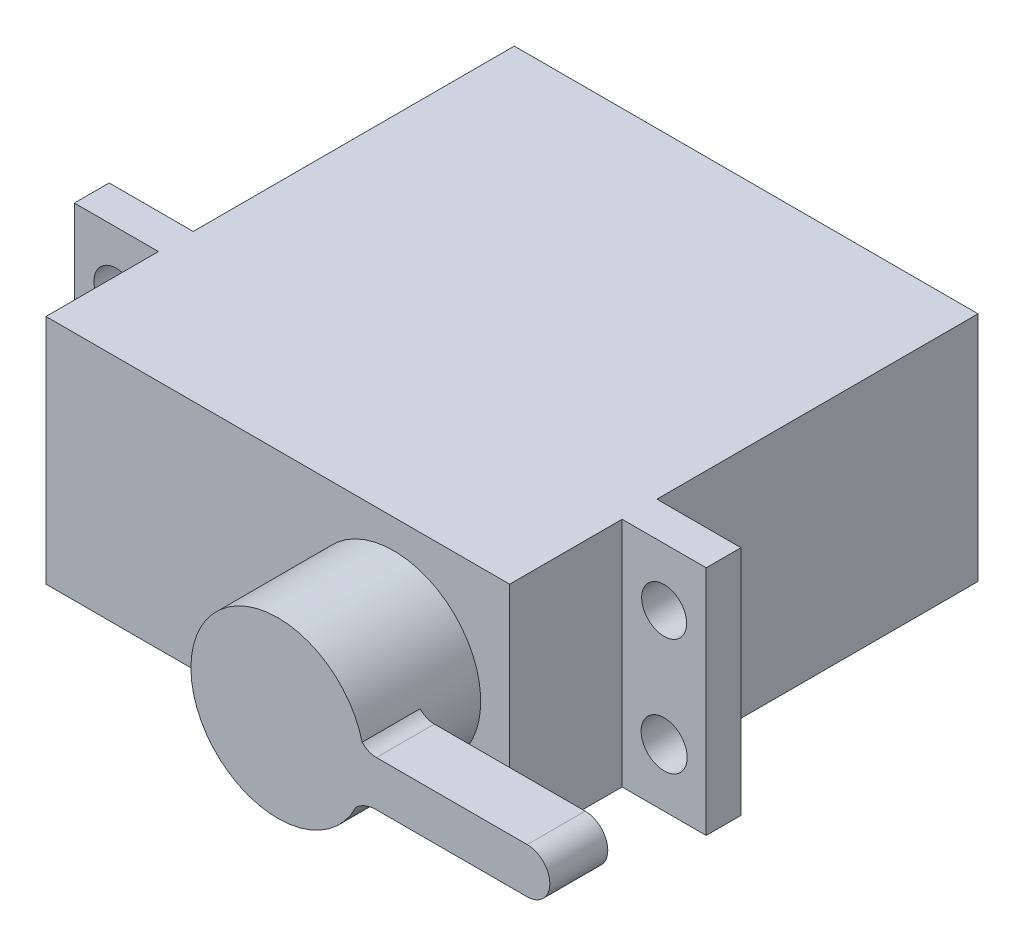
ISO-10303-21;
HEADER;
FILE_DESCRIPTION(('STEP AP214'),'2;1');
FILE_NAME('part.step','',(''),(''),'','','');
FILE_SCHEMA(('AUTOMOTIVE_DESIGN { 1 0 10303 214 1 1 1 1 }'));
ENDSEC;
DATA;
#1=APPLICATION_CONTEXT('core data for automotive mechanical design processes');
#2=APPLICATION_PROTOCOL_DEFINITION('international standard','automotive_design',2000,#1);
#3=PRODUCT_CONTEXT('',#1,'mechanical');
#4=PRODUCT('Part','Part','',(#3));
#5=PRODUCT_RELATED_PRODUCT_CATEGORY('part','',(#4));
#6=PRODUCT_DEFINITION_FORMATION('','',#4);
#7=PRODUCT_DEFINITION_CONTEXT('part definition',#1,'design');
#8=PRODUCT_DEFINITION('design','',#6,#7);
#9=PRODUCT_DEFINITION_SHAPE('','',#8);
#10=(LENGTH_UNIT() NAMED_UNIT(*) SI_UNIT(.MILLI.,.METRE.));
#11=(NAMED_UNIT(*) PLANE_ANGLE_UNIT() SI_UNIT($,.RADIAN.));
#12=(NAMED_UNIT(*) SI_UNIT($,.STERADIAN.) SOLID_ANGLE_UNIT());
#13=UNCERTAINTY_MEASURE_WITH_UNIT(LENGTH_MEASURE(1.E-05),#10,'distance_accuracy_value','');
#14=(GEOMETRIC_REPRESENTATION_CONTEXT(3) GLOBAL_UNCERTAINTY_ASSIGNED_CONTEXT((#13)) GLOBAL_UNIT_ASSIGNED_CONTEXT((#10,
#11,#12)) REPRESENTATION_CONTEXT('',''));
#15=CARTESIAN_POINT('',(0.,0.,0.));
#16=DIRECTION('',(0.,0.,1.));
#17=DIRECTION('',(1.,0.,0.));
#18=AXIS2_PLACEMENT_3D('',#15,#16,#17);
#19=CARTESIAN_POINT('',(-27.6844783715013,20.,-15.2600508905852));
#20=DIRECTION('',(1.,0.,0.));
#21=DIRECTION('',(0.,0.,-1.));
#22=AXIS2_PLACEMENT_3D('',#19,#20,#21);
#23=PLANE('',#22);
#24=DIRECTION('',(0.,0.,1.));
#25=VECTOR('',#24,1.);
#26=CARTESIAN_POINT('',(-27.6844783715013,20.,-15.2600508905852));
#27=LINE('',#26,#25);
#28=CARTESIAN_POINT('',(-27.6844783715013,20.,15.4399491094148));
#29=VERTEX_POINT('',#28);
#30=CARTESIAN_POINT('',(-27.6844783715013,20.,25.1399491094148));
#31=VERTEX_POINT('',#30);
#32=EDGE_CURVE('E289',#29,#31,#27,.T.);
#33=ORIENTED_EDGE('',*,*,#32,.F.);
#34=DIRECTION('',(0.,-1.,0.));
#35=VECTOR('',#34,1.);
#36=CARTESIAN_POINT('',(-27.6844783715013,20.,15.4399491094148));
#37=LINE('',#36,#35);
#38=CARTESIAN_POINT('',(-27.6844783715013,0.,15.4399491094148));
#39=VERTEX_POINT('',#38);
#40=EDGE_CURVE('E246',#29,#39,#37,.T.);
#41=ORIENTED_EDGE('',*,*,#40,.T.);
#42=DIRECTION('',(0.,0.,1.));
#43=VECTOR('',#42,1.);
#44=CARTESIAN_POINT('',(-27.6844783715013,0.,-15.2600508905852));
#45=LINE('',#44,#43);
#46=CARTESIAN_POINT('',(-27.6844783715013,0.,25.1399491094148));
#47=VERTEX_POINT('',#46);
#48=EDGE_CURVE('E284',#39,#47,#45,.T.);
#49=ORIENTED_EDGE('',*,*,#48,.T.);
#50=DIRECTION('',(0.,-1.,0.));
#51=VECTOR('',#50,1.);
#52=CARTESIAN_POINT('',(-27.6844783715013,20.,25.1399491094148));
#53=LINE('',#52,#51);
#54=EDGE_CURVE('E316',#31,#47,#53,.T.);
#55=ORIENTED_EDGE('',*,*,#54,.F.);
#56=EDGE_LOOP('',(#33,#41,#49,#55));
#57=FACE_BOUND('',#56,.T.);
#58=ADVANCED_FACE('F38',(#57),#23,.F.);
#59=CARTESIAN_POINT('',(12.3155216284987,20.,-15.2600508905852));
#60=DIRECTION('',(-1.,0.,0.));
#61=DIRECTION('',(0.,0.,1.));
#62=AXIS2_PLACEMENT_3D('',#59,#60,#61);
#63=PLANE('',#62);
#64=DIRECTION('',(0.,-1.,0.));
#65=VECTOR('',#64,1.);
#66=CARTESIAN_POINT('',(12.3155216284987,20.,15.4399491094148));
#67=LINE('',#66,#65);
#68=CARTESIAN_POINT('',(12.3155216284987,20.,15.4399491094148));
#69=VERTEX_POINT('',#68);
#70=CARTESIAN_POINT('',(12.3155216284987,0.,15.4399491094148));
#71=VERTEX_POINT('',#70);
#72=EDGE_CURVE('E257',#69,#71,#67,.T.);
#73=ORIENTED_EDGE('',*,*,#72,.F.);
#74=DIRECTION('',(0.,0.,-1.));
#75=VECTOR('',#74,1.);
#76=CARTESIAN_POINT('',(12.3155216284987,20.,-15.2600508905852));
#77=LINE('',#76,#75);
#78=CARTESIAN_POINT('',(12.3155216284987,20.,25.1399491094148));
#79=VERTEX_POINT('',#78);
#80=EDGE_CURVE('E292',#79,#69,#77,.T.);
#81=ORIENTED_EDGE('',*,*,#80,.F.);
#82=DIRECTION('',(0.,-1.,0.));
#83=VECTOR('',#82,1.);
#84=CARTESIAN_POINT('',(12.3155216284987,20.,25.1399491094148));
#85=LINE('',#84,#83);
#86=CARTESIAN_POINT('',(12.3155216284987,0.,25.1399491094148));
#87=VERTEX_POINT('',#86);
#88=EDGE_CURVE('E313',#79,#87,#85,.T.);
#89=ORIENTED_EDGE('',*,*,#88,.T.);
#90=DIRECTION('',(0.,0.,-1.));
#91=VECTOR('',#90,1.);
#92=CARTESIAN_POINT('',(12.3155216284987,0.,-15.2600508905852));
#93=LINE('',#92,#91);
#94=EDGE_CURVE('E304',#87,#71,#93,.T.);
#95=ORIENTED_EDGE('',*,*,#94,.T.);
#96=EDGE_LOOP('',(#73,#81,#89,#95));
#97=FACE_BOUND('',#96,.T.);
#98=ADVANCED_FACE('F344',(#97),#63,.F.);
#99=DIRECTION('',(0.,1.,0.));
#100=VECTOR('',#99,1.);
#101=CARTESIAN_POINT('',(12.3155216284987,20.,12.4399491094148));
#102=LINE('',#101,#100);
#103=CARTESIAN_POINT('',(12.3155216284987,0.,12.4399491094148));
#104=VERTEX_POINT('',#103);
#105=CARTESIAN_POINT('',(12.3155216284987,20.,12.4399491094148));
#106=VERTEX_POINT('',#105);
#107=EDGE_CURVE('E262',#104,#106,#102,.T.);
#108=ORIENTED_EDGE('',*,*,#107,.F.);
#109=CARTESIAN_POINT('',(12.3155216284987,0.,-15.2600508905852));
#110=VERTEX_POINT('',#109);
#111=EDGE_CURVE('E303',#104,#110,#93,.T.);
#112=ORIENTED_EDGE('',*,*,#111,.T.);
#113=DIRECTION('',(0.,-1.,0.));
#114=VECTOR('',#113,1.);
#115=CARTESIAN_POINT('',(12.3155216284987,20.,-15.2600508905852));
#116=LINE('',#115,#114);
#117=CARTESIAN_POINT('',(12.3155216284987,20.,-15.2600508905852));
#118=VERTEX_POINT('',#117);
#119=EDGE_CURVE('E310',#118,#110,#116,.T.);
#120=ORIENTED_EDGE('',*,*,#119,.F.);
#121=EDGE_CURVE('E291',#106,#118,#77,.T.);
#122=ORIENTED_EDGE('',*,*,#121,.F.);
#123=EDGE_LOOP('',(#108,#112,#120,#122));
#124=FACE_BOUND('',#123,.T.);
#125=ADVANCED_FACE('F377',(#124),#63,.F.);
#126=CARTESIAN_POINT('',(-27.6844783715013,0.,-15.2600508905852));
#127=VERTEX_POINT('',#126);
#128=CARTESIAN_POINT('',(-27.6844783715013,0.,12.4399491094148));
#129=VERTEX_POINT('',#128);
#130=EDGE_CURVE('E298',#127,#129,#45,.T.);
#131=ORIENTED_EDGE('',*,*,#130,.T.);
#132=DIRECTION('',(0.,1.,0.));
#133=VECTOR('',#132,1.);
#134=CARTESIAN_POINT('',(-27.6844783715013,20.,12.4399491094148));
#135=LINE('',#134,#133);
#136=CARTESIAN_POINT('',(-27.6844783715013,20.,12.4399491094148));
#137=VERTEX_POINT('',#136);
#138=EDGE_CURVE('E237',#129,#137,#135,.T.);
#139=ORIENTED_EDGE('',*,*,#138,.T.);
#140=CARTESIAN_POINT('',(-27.6844783715013,20.,-15.2600508905852));
#141=VERTEX_POINT('',#140);
#142=EDGE_CURVE('E285',#141,#137,#27,.T.);
#143=ORIENTED_EDGE('',*,*,#142,.F.);
#144=DIRECTION('',(0.,-1.,0.));
#145=VECTOR('',#144,1.);
#146=CARTESIAN_POINT('',(-27.6844783715013,20.,-15.2600508905852));
#147=LINE('',#146,#145);
#148=EDGE_CURVE('E297',#141,#127,#147,.T.);
#149=ORIENTED_EDGE('',*,*,#148,.T.);
#150=EDGE_LOOP('',(#131,#139,#143,#149));
#151=FACE_BOUND('',#150,.T.);
#152=ADVANCED_FACE('F40',(#151),#23,.F.);
#153=CARTESIAN_POINT('',(-27.6844783715013,20.,25.1399491094148));
#154=DIRECTION('',(0.,0.,-1.));
#155=DIRECTION('',(-1.,0.,0.));
#156=AXIS2_PLACEMENT_3D('',#153,#154,#155);
#157=PLANE('',#156);
#158=CARTESIAN_POINT('',(2.31552162849872,10.,25.1399491094148));
#159=DIRECTION('',(0.,0.,-1.));
#160=DIRECTION('',(-1.,0.,0.));
#161=AXIS2_PLACEMENT_3D('',#158,#159,#160);
#162=CIRCLE('',#161,7.5);
#163=CARTESIAN_POINT('',(-5.18447837150128,10.,25.1399491094148));
#164=VERTEX_POINT('',#163);
#165=EDGE_CURVE('E46',#164,#164,#162,.F.);
#166=ORIENTED_EDGE('',*,*,#165,.F.);
#167=EDGE_LOOP('',(#166));
#168=FACE_BOUND('',#167,.T.);
#169=DIRECTION('',(1.,0.,0.));
#170=VECTOR('',#169,1.);
#171=CARTESIAN_POINT('',(-27.6844783715013,0.,25.1399491094148));
#172=LINE('',#171,#170);
#173=EDGE_CURVE('E301',#47,#87,#172,.T.);
#174=ORIENTED_EDGE('',*,*,#173,.T.);
#175=ORIENTED_EDGE('',*,*,#88,.F.);
#176=DIRECTION('',(1.,0.,0.));
#177=VECTOR('',#176,1.);
#178=CARTESIAN_POINT('',(-27.6844783715013,20.,25.1399491094148));
#179=LINE('',#178,#177);
#180=EDGE_CURVE('E288',#31,#79,#179,.T.);
#181=ORIENTED_EDGE('',*,*,#180,.F.);
#182=ORIENTED_EDGE('',*,*,#54,.T.);
#183=EDGE_LOOP('',(#174,#175,#181,#182));
#184=FACE_BOUND('',#183,.T.);
#185=ADVANCED_FACE('F331',(#168,#184),#157,.F.);
#186=CARTESIAN_POINT('',(-27.6844783715013,20.,-15.2600508905852));
#187=DIRECTION('',(0.,0.,1.));
#188=DIRECTION('',(1.,0.,0.));
#189=AXIS2_PLACEMENT_3D('',#186,#187,#188);
#190=PLANE('',#189);
#191=DIRECTION('',(-1.,0.,0.));
#192=VECTOR('',#191,1.);
#193=CARTESIAN_POINT('',(-27.6844783715013,0.,-15.2600508905852));
#194=LINE('',#193,#192);
#195=EDGE_CURVE('E306',#110,#127,#194,.T.);
#196=ORIENTED_EDGE('',*,*,#195,.T.);
#197=ORIENTED_EDGE('',*,*,#148,.F.);
#198=DIRECTION('',(-1.,0.,0.));
#199=VECTOR('',#198,1.);
#200=CARTESIAN_POINT('',(-27.6844783715013,20.,-15.2600508905852));
#201=LINE('',#200,#199);
#202=EDGE_CURVE('E295',#118,#141,#201,.T.);
#203=ORIENTED_EDGE('',*,*,#202,.F.);
#204=ORIENTED_EDGE('',*,*,#119,.T.);
#205=EDGE_LOOP('',(#196,#197,#203,#204));
#206=FACE_BOUND('',#205,.T.);
#207=ADVANCED_FACE('F334',(#206),#190,.F.);
#208=CARTESIAN_POINT('',(0.,20.,0.));
#209=DIRECTION('',(0.,1.,0.));
#210=DIRECTION('',(0.,0.,1.));
#211=AXIS2_PLACEMENT_3D('',#208,#209,#210);
#212=PLANE('',#211);
#213=ORIENTED_EDGE('',*,*,#142,.T.);
#214=DIRECTION('',(1.,0.,0.));
#215=VECTOR('',#214,1.);
#216=CARTESIAN_POINT('',(-34.9344783715013,20.,12.4399491094148));
#217=LINE('',#216,#215);
#218=CARTESIAN_POINT('',(-34.9344783715013,20.,12.4399491094148));
#219=VERTEX_POINT('',#218);
#220=EDGE_CURVE('E61',#219,#137,#217,.T.);
#221=ORIENTED_EDGE('',*,*,#220,.F.);
#222=DIRECTION('',(0.,0.,1.));
#223=VECTOR('',#222,1.);
#224=CARTESIAN_POINT('',(-34.9344783715013,20.,15.4399491094148));
#225=LINE('',#224,#223);
#226=CARTESIAN_POINT('',(-34.9344783715013,20.,15.4399491094148));
#227=VERTEX_POINT('',#226);
#228=EDGE_CURVE('E236',#219,#227,#225,.T.);
#229=ORIENTED_EDGE('',*,*,#228,.T.);
#230=DIRECTION('',(1.,0.,0.));
#231=VECTOR('',#230,1.);
#232=CARTESIAN_POINT('',(-34.9344783715013,20.,15.4399491094148));
#233=LINE('',#232,#231);
#234=EDGE_CURVE('E255',#227,#29,#233,.T.);
#235=ORIENTED_EDGE('',*,*,#234,.T.);
#236=ORIENTED_EDGE('',*,*,#32,.T.);
#237=ORIENTED_EDGE('',*,*,#180,.T.);
#238=ORIENTED_EDGE('',*,*,#80,.T.);
#239=DIRECTION('',(-1.,0.,0.));
#240=VECTOR('',#239,1.);
#241=CARTESIAN_POINT('',(19.5655216284987,20.,15.4399491094148));
#242=LINE('',#241,#240);
#243=CARTESIAN_POINT('',(19.5655216284987,20.,15.4399491094148));
#244=VERTEX_POINT('',#243);
#245=EDGE_CURVE('E268',#244,#69,#242,.T.);
#246=ORIENTED_EDGE('',*,*,#245,.F.);
#247=DIRECTION('',(0.,0.,1.));
#248=VECTOR('',#247,1.);
#249=CARTESIAN_POINT('',(19.5655216284987,20.,15.4399491094148));
#250=LINE('',#249,#248);
#251=CARTESIAN_POINT('',(19.5655216284987,20.,12.4399491094148));
#252=VERTEX_POINT('',#251);
#253=EDGE_CURVE('E266',#252,#244,#250,.T.);
#254=ORIENTED_EDGE('',*,*,#253,.F.);
#255=DIRECTION('',(-1.,0.,0.));
#256=VECTOR('',#255,1.);
#257=CARTESIAN_POINT('',(19.5655216284987,20.,12.4399491094148));
#258=LINE('',#257,#256);
#259=EDGE_CURVE('E275',#252,#106,#258,.T.);
#260=ORIENTED_EDGE('',*,*,#259,.T.);
#261=ORIENTED_EDGE('',*,*,#121,.T.);
#262=ORIENTED_EDGE('',*,*,#202,.T.);
#263=EDGE_LOOP('',(#213,#221,#229,#235,#236,#237,#238,#246,#254,#260,#261,#262));
#264=FACE_BOUND('',#263,.T.);
#265=ADVANCED_FACE('F354',(#264),#212,.T.);
#266=CARTESIAN_POINT('',(0.,0.,0.));
#267=DIRECTION('',(0.,1.,0.));
#268=DIRECTION('',(0.,0.,1.));
#269=AXIS2_PLACEMENT_3D('',#266,#267,#268);
#270=PLANE('',#269);
#271=ORIENTED_EDGE('',*,*,#130,.F.);
#272=ORIENTED_EDGE('',*,*,#195,.F.);
#273=ORIENTED_EDGE('',*,*,#111,.F.);
#274=DIRECTION('',(-1.,0.,0.));
#275=VECTOR('',#274,1.);
#276=CARTESIAN_POINT('',(19.5655216284987,0.,12.4399491094148));
#277=LINE('',#276,#275);
#278=CARTESIAN_POINT('',(19.5655216284987,0.,12.4399491094148));
#279=VERTEX_POINT('',#278);
#280=EDGE_CURVE('E278',#279,#104,#277,.T.);
#281=ORIENTED_EDGE('',*,*,#280,.F.);
#282=DIRECTION('',(0.,0.,-1.));
#283=VECTOR('',#282,1.);
#284=CARTESIAN_POINT('',(19.5655216284987,0.,15.4399491094147));
#285=LINE('',#284,#283);
#286=CARTESIAN_POINT('',(19.5655216284987,0.,15.4399491094147));
#287=VERTEX_POINT('',#286);
#288=EDGE_CURVE('E261',#287,#279,#285,.T.);
#289=ORIENTED_EDGE('',*,*,#288,.F.);
#290=DIRECTION('',(-1.,0.,0.));
#291=VECTOR('',#290,1.);
#292=CARTESIAN_POINT('',(19.5655216284987,0.,15.4399491094147));
#293=LINE('',#292,#291);
#294=EDGE_CURVE('E281',#287,#71,#293,.T.);
#295=ORIENTED_EDGE('',*,*,#294,.T.);
#296=ORIENTED_EDGE('',*,*,#94,.F.);
#297=ORIENTED_EDGE('',*,*,#173,.F.);
#298=ORIENTED_EDGE('',*,*,#48,.F.);
#299=DIRECTION('',(1.,0.,0.));
#300=VECTOR('',#299,1.);
#301=CARTESIAN_POINT('',(-34.9344783715013,0.,15.4399491094148));
#302=LINE('',#301,#300);
#303=CARTESIAN_POINT('',(-34.9344783715013,0.,15.4399491094148));
#304=VERTEX_POINT('',#303);
#305=EDGE_CURVE('E245',#304,#39,#302,.T.);
#306=ORIENTED_EDGE('',*,*,#305,.F.);
#307=DIRECTION('',(0.,0.,-1.));
#308=VECTOR('',#307,1.);
#309=CARTESIAN_POINT('',(-34.9344783715013,0.,15.4399491094148));
#310=LINE('',#309,#308);
#311=CARTESIAN_POINT('',(-34.9344783715013,0.,12.4399491094148));
#312=VERTEX_POINT('',#311);
#313=EDGE_CURVE('E242',#304,#312,#310,.T.);
#314=ORIENTED_EDGE('',*,*,#313,.T.);
#315=DIRECTION('',(1.,0.,0.));
#316=VECTOR('',#315,1.);
#317=CARTESIAN_POINT('',(-34.9344783715013,0.,12.4399491094148));
#318=LINE('',#317,#316);
#319=EDGE_CURVE('E252',#312,#129,#318,.T.);
#320=ORIENTED_EDGE('',*,*,#319,.T.);
#321=EDGE_LOOP('',(#271,#272,#273,#281,#289,#295,#296,#297,#298,#306,#314,#320));
#322=FACE_BOUND('',#321,.T.);
#323=ADVANCED_FACE('F346',(#322),#270,.F.);
#324=CARTESIAN_POINT('',(19.5655216284987,20.,15.4399491094148));
#325=DIRECTION('',(0.,0.,-1.));
#326=DIRECTION('',(0.,1.,0.));
#327=AXIS2_PLACEMENT_3D('',#324,#325,#326);
#328=PLANE('',#327);
#329=CARTESIAN_POINT('',(15.9405216284987,15.,15.4399491094148));
#330=DIRECTION('',(0.,0.,1.));
#331=DIRECTION('',(1.,0.,0.));
#332=AXIS2_PLACEMENT_3D('',#329,#330,#331);
#333=CIRCLE('',#332,1.93888787697926);
#334=CARTESIAN_POINT('',(17.879409505478,15.,15.4399491094148));
#335=VERTEX_POINT('',#334);
#336=EDGE_CURVE('E225',#335,#335,#333,.T.);
#337=ORIENTED_EDGE('',*,*,#336,.F.);
#338=EDGE_LOOP('',(#337));
#339=FACE_BOUND('',#338,.T.);
#340=CARTESIAN_POINT('',(15.9405216284987,5.,15.4399491094148));
#341=DIRECTION('',(0.,0.,1.));
#342=DIRECTION('',(1.,0.,0.));
#343=AXIS2_PLACEMENT_3D('',#340,#341,#342);
#344=CIRCLE('',#343,1.9865029201618);
#345=CARTESIAN_POINT('',(17.9270245486605,5.,15.4399491094148));
#346=VERTEX_POINT('',#345);
#347=EDGE_CURVE('E229',#346,#346,#344,.T.);
#348=ORIENTED_EDGE('',*,*,#347,.F.);
#349=EDGE_LOOP('',(#348));
#350=FACE_BOUND('',#349,.T.);
#351=ORIENTED_EDGE('',*,*,#72,.T.);
#352=ORIENTED_EDGE('',*,*,#294,.F.);
#353=DIRECTION('',(0.,-1.,0.));
#354=VECTOR('',#353,1.);
#355=CARTESIAN_POINT('',(19.5655216284987,20.,15.4399491094148));
#356=LINE('',#355,#354);
#357=EDGE_CURVE('E258',#244,#287,#356,.T.);
#358=ORIENTED_EDGE('',*,*,#357,.F.);
#359=ORIENTED_EDGE('',*,*,#245,.T.);
#360=EDGE_LOOP('',(#351,#352,#358,#359));
#361=FACE_BOUND('',#360,.T.);
#362=ADVANCED_FACE('F351',(#339,#350,#361),#328,.F.);
#363=CARTESIAN_POINT('',(19.5655216284987,20.,12.4399491094148));
#364=DIRECTION('',(0.,0.,1.));
#365=DIRECTION('',(1.,0.,0.));
#366=AXIS2_PLACEMENT_3D('',#363,#364,#365);
#367=PLANE('',#366);
#368=CARTESIAN_POINT('',(15.9405216284987,15.,12.4399491094148));
#369=DIRECTION('',(0.,0.,1.));
#370=DIRECTION('',(1.,0.,0.));
#371=AXIS2_PLACEMENT_3D('',#368,#369,#370);
#372=CIRCLE('',#371,1.93888787697926);
#373=CARTESIAN_POINT('',(17.879409505478,15.,12.4399491094148));
#374=VERTEX_POINT('',#373);
#375=EDGE_CURVE('E249',#374,#374,#372,.T.);
#376=ORIENTED_EDGE('',*,*,#375,.T.);
#377=EDGE_LOOP('',(#376));
#378=FACE_BOUND('',#377,.T.);
#379=CARTESIAN_POINT('',(15.9405216284987,5.,12.4399491094148));
#380=DIRECTION('',(0.,0.,1.));
#381=DIRECTION('',(1.,0.,0.));
#382=AXIS2_PLACEMENT_3D('',#379,#380,#381);
#383=CIRCLE('',#382,1.9865029201618);
#384=CARTESIAN_POINT('',(17.9270245486605,5.,12.4399491094148));
#385=VERTEX_POINT('',#384);
#386=EDGE_CURVE('E228',#385,#385,#383,.T.);
#387=ORIENTED_EDGE('',*,*,#386,.T.);
#388=EDGE_LOOP('',(#387));
#389=FACE_BOUND('',#388,.T.);
#390=ORIENTED_EDGE('',*,*,#107,.T.);
#391=ORIENTED_EDGE('',*,*,#259,.F.);
#392=DIRECTION('',(0.,1.,0.));
#393=VECTOR('',#392,1.);
#394=CARTESIAN_POINT('',(19.5655216284987,20.,12.4399491094148));
#395=LINE('',#394,#393);
#396=EDGE_CURVE('E264',#279,#252,#395,.T.);
#397=ORIENTED_EDGE('',*,*,#396,.F.);
#398=ORIENTED_EDGE('',*,*,#280,.T.);
#399=EDGE_LOOP('',(#390,#391,#397,#398));
#400=FACE_BOUND('',#399,.T.);
#401=ADVANCED_FACE('F380',(#378,#389,#400),#367,.F.);
#402=CARTESIAN_POINT('',(19.5655216284987,0.,0.));
#403=DIRECTION('',(1.,0.,0.));
#404=DIRECTION('',(0.,0.,-1.));
#405=AXIS2_PLACEMENT_3D('',#402,#403,#404);
#406=PLANE('',#405);
#407=ORIENTED_EDGE('',*,*,#357,.T.);
#408=ORIENTED_EDGE('',*,*,#288,.T.);
#409=ORIENTED_EDGE('',*,*,#396,.T.);
#410=ORIENTED_EDGE('',*,*,#253,.T.);
#411=EDGE_LOOP('',(#407,#408,#409,#410));
#412=FACE_BOUND('',#411,.T.);
#413=ADVANCED_FACE('F383',(#412),#406,.T.);
#414=CARTESIAN_POINT('',(-34.9344783715013,20.,15.4399491094148));
#415=DIRECTION('',(0.,0.,1.));
#416=DIRECTION('',(0.,-1.,0.));
#417=AXIS2_PLACEMENT_3D('',#414,#415,#416);
#418=PLANE('',#417);
#419=CARTESIAN_POINT('',(-31.3094783715013,15.,15.4399491094148));
#420=DIRECTION('',(0.,0.,-1.));
#421=DIRECTION('',(-1.,0.,0.));
#422=AXIS2_PLACEMENT_3D('',#419,#420,#421);
#423=CIRCLE('',#422,1.93888787697926);
#424=CARTESIAN_POINT('',(-33.2483662484805,15.,15.4399491094148));
#425=VERTEX_POINT('',#424);
#426=EDGE_CURVE('E219',#425,#425,#423,.T.);
#427=ORIENTED_EDGE('',*,*,#426,.T.);
#428=EDGE_LOOP('',(#427));
#429=FACE_BOUND('',#428,.T.);
#430=CARTESIAN_POINT('',(-31.3094783715013,5.,15.4399491094148));
#431=DIRECTION('',(0.,0.,-1.));
#432=DIRECTION('',(-1.,0.,0.));
#433=AXIS2_PLACEMENT_3D('',#430,#431,#432);
#434=CIRCLE('',#433,1.9865029201618);
#435=CARTESIAN_POINT('',(-33.2959812916631,5.,15.4399491094148));
#436=VERTEX_POINT('',#435);
#437=EDGE_CURVE('E218',#436,#436,#434,.T.);
#438=ORIENTED_EDGE('',*,*,#437,.T.);
#439=EDGE_LOOP('',(#438));
#440=FACE_BOUND('',#439,.T.);
#441=ORIENTED_EDGE('',*,*,#40,.F.);
#442=ORIENTED_EDGE('',*,*,#234,.F.);
#443=DIRECTION('',(0.,-1.,0.));
#444=VECTOR('',#443,1.);
#445=CARTESIAN_POINT('',(-34.9344783715013,20.,15.4399491094148));
#446=LINE('',#445,#444);
#447=EDGE_CURVE('E233',#227,#304,#446,.T.);
#448=ORIENTED_EDGE('',*,*,#447,.T.);
#449=ORIENTED_EDGE('',*,*,#305,.T.);
#450=EDGE_LOOP('',(#441,#442,#448,#449));
#451=FACE_BOUND('',#450,.T.);
#452=ADVANCED_FACE('F362',(#429,#440,#451),#418,.T.);
#453=CARTESIAN_POINT('',(-34.9344783715013,20.,12.4399491094148));
#454=DIRECTION('',(0.,0.,-1.));
#455=DIRECTION('',(-1.,0.,0.));
#456=AXIS2_PLACEMENT_3D('',#453,#454,#455);
#457=PLANE('',#456);
#458=CARTESIAN_POINT('',(-31.3094783715013,15.,12.4399491094148));
#459=DIRECTION('',(0.,0.,-1.));
#460=DIRECTION('',(-1.,0.,0.));
#461=AXIS2_PLACEMENT_3D('',#458,#459,#460);
#462=CIRCLE('',#461,1.93888787697926);
#463=CARTESIAN_POINT('',(-33.2483662484805,15.,12.4399491094148));
#464=VERTEX_POINT('',#463);
#465=EDGE_CURVE('E232',#464,#464,#462,.F.);
#466=ORIENTED_EDGE('',*,*,#465,.T.);
#467=EDGE_LOOP('',(#466));
#468=FACE_BOUND('',#467,.T.);
#469=CARTESIAN_POINT('',(-31.3094783715013,5.,12.4399491094148));
#470=DIRECTION('',(0.,0.,-1.));
#471=DIRECTION('',(-1.,0.,0.));
#472=AXIS2_PLACEMENT_3D('',#469,#470,#471);
#473=CIRCLE('',#472,1.9865029201618);
#474=CARTESIAN_POINT('',(-33.2959812916631,5.,12.4399491094148));
#475=VERTEX_POINT('',#474);
#476=EDGE_CURVE('E222',#475,#475,#473,.F.);
#477=ORIENTED_EDGE('',*,*,#476,.T.);
#478=EDGE_LOOP('',(#477));
#479=FACE_BOUND('',#478,.T.);
#480=ORIENTED_EDGE('',*,*,#138,.F.);
#481=ORIENTED_EDGE('',*,*,#319,.F.);
#482=DIRECTION('',(0.,1.,0.));
#483=VECTOR('',#482,1.);
#484=CARTESIAN_POINT('',(-34.9344783715013,20.,12.4399491094148));
#485=LINE('',#484,#483);
#486=EDGE_CURVE('E240',#312,#219,#485,.T.);
#487=ORIENTED_EDGE('',*,*,#486,.T.);
#488=ORIENTED_EDGE('',*,*,#220,.T.);
#489=EDGE_LOOP('',(#480,#481,#487,#488));
#490=FACE_BOUND('',#489,.T.);
#491=ADVANCED_FACE('F367',(#468,#479,#490),#457,.T.);
#492=CARTESIAN_POINT('',(-34.9344783715013,0.,0.));
#493=DIRECTION('',(-1.,0.,0.));
#494=DIRECTION('',(0.,0.,-1.));
#495=AXIS2_PLACEMENT_3D('',#492,#493,#494);
#496=PLANE('',#495);
#497=ORIENTED_EDGE('',*,*,#447,.F.);
#498=ORIENTED_EDGE('',*,*,#228,.F.);
#499=ORIENTED_EDGE('',*,*,#486,.F.);
#500=ORIENTED_EDGE('',*,*,#313,.F.);
#501=EDGE_LOOP('',(#497,#498,#499,#500));
#502=FACE_BOUND('',#501,.T.);
#503=ADVANCED_FACE('F366',(#502),#496,.T.);
#504=CARTESIAN_POINT('',(15.9405216284987,5.,8.18994910941475));
#505=DIRECTION('',(0.,0.,1.));
#506=DIRECTION('',(1.,0.,0.));
#507=AXIS2_PLACEMENT_3D('',#504,#505,#506);
#508=CYLINDRICAL_SURFACE('',#507,1.9865029201618);
#509=ORIENTED_EDGE('',*,*,#347,.T.);
#510=EDGE_LOOP('',(#509));
#511=FACE_BOUND('',#510,.T.);
#512=ORIENTED_EDGE('',*,*,#386,.F.);
#513=EDGE_LOOP('',(#512));
#514=FACE_BOUND('',#513,.T.);
#515=ADVANCED_FACE('F420',(#511,#514),#508,.F.);
#516=CARTESIAN_POINT('',(15.9405216284987,15.,8.18994910941475));
#517=DIRECTION('',(0.,0.,1.));
#518=DIRECTION('',(1.,0.,0.));
#519=AXIS2_PLACEMENT_3D('',#516,#517,#518);
#520=CYLINDRICAL_SURFACE('',#519,1.93888787697926);
#521=ORIENTED_EDGE('',*,*,#336,.T.);
#522=EDGE_LOOP('',(#521));
#523=FACE_BOUND('',#522,.T.);
#524=ORIENTED_EDGE('',*,*,#375,.F.);
#525=EDGE_LOOP('',(#524));
#526=FACE_BOUND('',#525,.T.);
#527=ADVANCED_FACE('F423',(#523,#526),#520,.F.);
#528=CARTESIAN_POINT('',(-31.3094783715013,5.,8.18994910941476));
#529=DIRECTION('',(0.,0.,1.));
#530=DIRECTION('',(1.,0.,0.));
#531=AXIS2_PLACEMENT_3D('',#528,#529,#530);
#532=CYLINDRICAL_SURFACE('',#531,1.9865029201618);
#533=ORIENTED_EDGE('',*,*,#476,.F.);
#534=EDGE_LOOP('',(#533));
#535=FACE_BOUND('',#534,.T.);
#536=ORIENTED_EDGE('',*,*,#437,.F.);
#537=EDGE_LOOP('',(#536));
#538=FACE_BOUND('',#537,.T.);
#539=ADVANCED_FACE('F431',(#535,#538),#532,.F.);
#540=CARTESIAN_POINT('',(-31.3094783715013,15.,8.18994910941476));
#541=DIRECTION('',(0.,0.,1.));
#542=DIRECTION('',(1.,0.,0.));
#543=AXIS2_PLACEMENT_3D('',#540,#541,#542);
#544=CYLINDRICAL_SURFACE('',#543,1.93888787697926);
#545=ORIENTED_EDGE('',*,*,#465,.F.);
#546=EDGE_LOOP('',(#545));
#547=FACE_BOUND('',#546,.T.);
#548=ORIENTED_EDGE('',*,*,#426,.F.);
#549=EDGE_LOOP('',(#548));
#550=FACE_BOUND('',#549,.T.);
#551=ADVANCED_FACE('F447',(#547,#550),#544,.F.);
#552=CARTESIAN_POINT('',(2.31552162849872,10.,35.1399491094148));
#553=DIRECTION('',(0.,0.,-1.));
#554=DIRECTION('',(-1.,0.,0.));
#555=AXIS2_PLACEMENT_3D('',#552,#553,#554);
#556=CYLINDRICAL_SURFACE('',#555,7.5);
#557=DIRECTION('',(0.,0.,1.));
#558=VECTOR('',#557,1.);
#559=CARTESIAN_POINT('',(9.06098603686251,6.72147747979408,30.1399491094148));
#560=LINE('',#559,#558);
#561=CARTESIAN_POINT('',(9.06098603686251,6.72147747979408,30.1399491094148));
#562=VERTEX_POINT('',#561);
#563=CARTESIAN_POINT('',(9.06098603686251,6.72147747979408,35.1399491094148));
#564=VERTEX_POINT('',#563);
#565=EDGE_CURVE('E189',#562,#564,#560,.T.);
#566=ORIENTED_EDGE('',*,*,#565,.T.);
#567=CARTESIAN_POINT('',(2.31552162849872,10.,35.1399491094148));
#568=DIRECTION('',(0.,0.,1.));
#569=DIRECTION('',(1.,0.,0.));
#570=AXIS2_PLACEMENT_3D('',#567,#568,#569);
#571=CIRCLE('',#570,7.5);
#572=CARTESIAN_POINT('',(9.5890624295112,11.8290992909098,35.1399491094148));
#573=VERTEX_POINT('',#572);
#574=EDGE_CURVE('E216',#573,#564,#571,.T.);
#575=ORIENTED_EDGE('',*,*,#574,.F.);
#576=DIRECTION('',(0.,0.,1.));
#577=VECTOR('',#576,1.);
#578=CARTESIAN_POINT('',(9.5890624295112,11.8290992909098,32.6399491094148));
#579=LINE('',#578,#577);
#580=CARTESIAN_POINT('',(9.58906242951119,11.8290992909098,30.1399491094148));
#581=VERTEX_POINT('',#580);
#582=EDGE_CURVE('E208',#573,#581,#579,.F.);
#583=ORIENTED_EDGE('',*,*,#582,.T.);
#584=CARTESIAN_POINT('',(2.31552162849872,10.,30.1399491094148));
#585=DIRECTION('',(0.,0.,1.));
#586=DIRECTION('',(1.,0.,0.));
#587=AXIS2_PLACEMENT_3D('',#584,#585,#586);
#588=CIRCLE('',#587,7.5);
#589=EDGE_CURVE('E11',#562,#581,#588,.T.);
#590=ORIENTED_EDGE('',*,*,#589,.F.);
#591=EDGE_LOOP('',(#566,#575,#583,#590));
#592=FACE_BOUND('',#591,.T.);
#593=ORIENTED_EDGE('',*,*,#165,.T.);
#594=EDGE_LOOP('',(#593));
#595=FACE_BOUND('',#594,.T.);
#596=ADVANCED_FACE('F329',(#592,#595),#556,.T.);
#597=CARTESIAN_POINT('',(2.31552162849872,10.,35.1399491094148));
#598=DIRECTION('',(0.,0.,1.));
#599=DIRECTION('',(1.,0.,0.));
#600=AXIS2_PLACEMENT_3D('',#597,#598,#599);
#601=PLANE('',#600);
#602=ORIENTED_EDGE('',*,*,#574,.T.);
#603=CARTESIAN_POINT('',(10.8184681165459,4.7770195283361,35.1399491094148));
#604=DIRECTION('',(0.,0.,-1.));
#605=DIRECTION('',(1.,0.,0.));
#606=AXIS2_PLACEMENT_3D('',#603,#604,#605);
#607=CIRCLE('',#606,2.62100362178241);
#608=CARTESIAN_POINT('',(10.8184681165459,7.39802315011851,35.1399491094148));
#609=VERTEX_POINT('',#608);
#610=EDGE_CURVE('E200',#564,#609,#607,.T.);
#611=ORIENTED_EDGE('',*,*,#610,.T.);
#612=DIRECTION('',(1.,0.,0.));
#613=VECTOR('',#612,1.);
#614=CARTESIAN_POINT('',(10.8184681165459,7.39802315011851,35.1399491094148));
#615=LINE('',#614,#613);
#616=CARTESIAN_POINT('',(23.8283523659541,7.39802315011851,35.1399491094148));
#617=VERTEX_POINT('',#616);
#618=EDGE_CURVE('E169',#609,#617,#615,.T.);
#619=ORIENTED_EDGE('',*,*,#618,.T.);
#620=CARTESIAN_POINT('',(23.8283523659541,9.34950578752974,35.1399491094148));
#621=DIRECTION('',(0.,0.,1.));
#622=DIRECTION('',(-1.,0.,0.));
#623=AXIS2_PLACEMENT_3D('',#620,#621,#622);
#624=CIRCLE('',#623,1.95148263741123);
#625=CARTESIAN_POINT('',(23.8283523659541,11.300988424941,35.1399491094148));
#626=VERTEX_POINT('',#625);
#627=EDGE_CURVE('E203',#617,#626,#624,.T.);
#628=ORIENTED_EDGE('',*,*,#627,.T.);
#629=DIRECTION('',(-1.,0.,0.));
#630=VECTOR('',#629,1.);
#631=CARTESIAN_POINT('',(10.8184681165459,11.300988424941,35.1399491094148));
#632=LINE('',#631,#630);
#633=CARTESIAN_POINT('',(10.8184681165459,11.300988424941,35.1399491094148));
#634=VERTEX_POINT('',#633);
#635=EDGE_CURVE('E191',#626,#634,#632,.T.);
#636=ORIENTED_EDGE('',*,*,#635,.T.);
#637=CARTESIAN_POINT('',(10.8184681165459,12.9960296988818,35.1399491094148));
#638=DIRECTION('',(0.,0.,-1.));
#639=DIRECTION('',(-1.,0.,0.));
#640=AXIS2_PLACEMENT_3D('',#637,#638,#639);
#641=CIRCLE('',#640,1.69504127394087);
#642=EDGE_CURVE('E53',#634,#573,#641,.T.);
#643=ORIENTED_EDGE('',*,*,#642,.T.);
#644=EDGE_LOOP('',(#602,#611,#619,#628,#636,#643));
#645=FACE_BOUND('',#644,.T.);
#646=ADVANCED_FACE('F458',(#645),#601,.T.);
#647=CARTESIAN_POINT('',(10.8184681165459,12.9960296988818,30.1399491094148));
#648=DIRECTION('',(0.,0.,1.));
#649=DIRECTION('',(1.,0.,0.));
#650=AXIS2_PLACEMENT_3D('',#647,#648,#649);
#651=CYLINDRICAL_SURFACE('',#650,1.69504127394087);
#652=ORIENTED_EDGE('',*,*,#582,.F.);
#653=ORIENTED_EDGE('',*,*,#642,.F.);
#654=DIRECTION('',(0.,0.,1.));
#655=VECTOR('',#654,1.);
#656=CARTESIAN_POINT('',(10.8184681165459,11.300988424941,30.1399491094148));
#657=LINE('',#656,#655);
#658=CARTESIAN_POINT('',(10.8184681165459,11.300988424941,30.1399491094148));
#659=VERTEX_POINT('',#658);
#660=EDGE_CURVE('E209',#659,#634,#657,.T.);
#661=ORIENTED_EDGE('',*,*,#660,.F.);
#662=CARTESIAN_POINT('',(10.8184681165459,12.9960296988818,30.1399491094148));
#663=DIRECTION('',(0.,0.,-1.));
#664=DIRECTION('',(-1.,0.,0.));
#665=AXIS2_PLACEMENT_3D('',#662,#663,#664);
#666=CIRCLE('',#665,1.69504127394087);
#667=EDGE_CURVE('E175',#659,#581,#666,.T.);
#668=ORIENTED_EDGE('',*,*,#667,.T.);
#669=EDGE_LOOP('',(#652,#653,#661,#668));
#670=FACE_BOUND('',#669,.T.);
#671=ADVANCED_FACE('F462',(#670),#651,.F.);
#672=CARTESIAN_POINT('',(10.8184681165459,4.7770195283361,30.1399491094148));
#673=DIRECTION('',(0.,0.,1.));
#674=DIRECTION('',(1.,0.,0.));
#675=AXIS2_PLACEMENT_3D('',#672,#673,#674);
#676=CYLINDRICAL_SURFACE('',#675,2.62100362178241);
#677=ORIENTED_EDGE('',*,*,#610,.F.);
#678=ORIENTED_EDGE('',*,*,#565,.F.);
#679=CARTESIAN_POINT('',(10.8184681165459,4.7770195283361,30.1399491094148));
#680=DIRECTION('',(0.,0.,-1.));
#681=DIRECTION('',(1.,0.,0.));
#682=AXIS2_PLACEMENT_3D('',#679,#680,#681);
#683=CIRCLE('',#682,2.62100362178241);
#684=CARTESIAN_POINT('',(10.8184681165459,7.39802315011851,30.1399491094148));
#685=VERTEX_POINT('',#684);
#686=EDGE_CURVE('E181',#562,#685,#683,.T.);
#687=ORIENTED_EDGE('',*,*,#686,.T.);
#688=DIRECTION('',(0.,0.,1.));
#689=VECTOR('',#688,1.);
#690=CARTESIAN_POINT('',(10.8184681165459,7.39802315011851,30.1399491094148));
#691=LINE('',#690,#689);
#692=EDGE_CURVE('E164',#685,#609,#691,.T.);
#693=ORIENTED_EDGE('',*,*,#692,.T.);
#694=EDGE_LOOP('',(#677,#678,#687,#693));
#695=FACE_BOUND('',#694,.T.);
#696=ADVANCED_FACE('F187',(#695),#676,.F.);
#697=CARTESIAN_POINT('',(10.8184681165459,11.300988424941,30.1399491094148));
#698=DIRECTION('',(0.,1.,0.));
#699=DIRECTION('',(0.,0.,1.));
#700=AXIS2_PLACEMENT_3D('',#697,#698,#699);
#701=PLANE('',#700);
#702=ORIENTED_EDGE('',*,*,#635,.F.);
#703=DIRECTION('',(0.,0.,1.));
#704=VECTOR('',#703,1.);
#705=CARTESIAN_POINT('',(23.8283523659541,11.300988424941,30.1399491094148));
#706=LINE('',#705,#704);
#707=CARTESIAN_POINT('',(23.8283523659541,11.300988424941,30.1399491094148));
#708=VERTEX_POINT('',#707);
#709=EDGE_CURVE('E211',#708,#626,#706,.T.);
#710=ORIENTED_EDGE('',*,*,#709,.F.);
#711=DIRECTION('',(-1.,0.,0.));
#712=VECTOR('',#711,1.);
#713=CARTESIAN_POINT('',(10.8184681165459,11.300988424941,30.1399491094148));
#714=LINE('',#713,#712);
#715=EDGE_CURVE('E195',#708,#659,#714,.T.);
#716=ORIENTED_EDGE('',*,*,#715,.T.);
#717=ORIENTED_EDGE('',*,*,#660,.T.);
#718=EDGE_LOOP('',(#702,#710,#716,#717));
#719=FACE_BOUND('',#718,.T.);
#720=ADVANCED_FACE('F465',(#719),#701,.T.);
#721=CARTESIAN_POINT('',(23.8283523659541,9.34950578752974,30.1399491094148));
#722=DIRECTION('',(0.,0.,1.));
#723=DIRECTION('',(1.,0.,0.));
#724=AXIS2_PLACEMENT_3D('',#721,#722,#723);
#725=CYLINDRICAL_SURFACE('',#724,1.95148263741123);
#726=ORIENTED_EDGE('',*,*,#627,.F.);
#727=DIRECTION('',(0.,0.,1.));
#728=VECTOR('',#727,1.);
#729=CARTESIAN_POINT('',(23.8283523659541,7.39802315011851,30.1399491094148));
#730=LINE('',#729,#728);
#731=CARTESIAN_POINT('',(23.8283523659541,7.39802315011851,30.1399491094148));
#732=VERTEX_POINT('',#731);
#733=EDGE_CURVE('E174',#732,#617,#730,.T.);
#734=ORIENTED_EDGE('',*,*,#733,.F.);
#735=CARTESIAN_POINT('',(23.8283523659541,9.34950578752974,30.1399491094148));
#736=DIRECTION('',(0.,0.,1.));
#737=DIRECTION('',(-1.,0.,0.));
#738=AXIS2_PLACEMENT_3D('',#735,#736,#737);
#739=CIRCLE('',#738,1.95148263741123);
#740=EDGE_CURVE('E185',#732,#708,#739,.T.);
#741=ORIENTED_EDGE('',*,*,#740,.T.);
#742=ORIENTED_EDGE('',*,*,#709,.T.);
#743=EDGE_LOOP('',(#726,#734,#741,#742));
#744=FACE_BOUND('',#743,.T.);
#745=ADVANCED_FACE('F468',(#744),#725,.T.);
#746=CARTESIAN_POINT('',(10.8184681165459,7.39802315011851,30.1399491094148));
#747=DIRECTION('',(0.,-1.,0.));
#748=DIRECTION('',(0.,0.,-1.));
#749=AXIS2_PLACEMENT_3D('',#746,#747,#748);
#750=PLANE('',#749);
#751=ORIENTED_EDGE('',*,*,#618,.F.);
#752=ORIENTED_EDGE('',*,*,#692,.F.);
#753=DIRECTION('',(1.,0.,0.));
#754=VECTOR('',#753,1.);
#755=CARTESIAN_POINT('',(10.8184681165459,7.39802315011851,30.1399491094148));
#756=LINE('',#755,#754);
#757=EDGE_CURVE('E167',#685,#732,#756,.T.);
#758=ORIENTED_EDGE('',*,*,#757,.T.);
#759=ORIENTED_EDGE('',*,*,#733,.T.);
#760=EDGE_LOOP('',(#751,#752,#758,#759));
#761=FACE_BOUND('',#760,.T.);
#762=ADVANCED_FACE('F166',(#761),#750,.T.);
#763=CARTESIAN_POINT('',(10.8184681165459,4.7770195283361,30.1399491094148));
#764=DIRECTION('',(0.,0.,1.));
#765=DIRECTION('',(1.,0.,0.));
#766=AXIS2_PLACEMENT_3D('',#763,#764,#765);
#767=PLANE('',#766);
#768=ORIENTED_EDGE('',*,*,#686,.F.);
#769=ORIENTED_EDGE('',*,*,#589,.T.);
#770=ORIENTED_EDGE('',*,*,#667,.F.);
#771=ORIENTED_EDGE('',*,*,#715,.F.);
#772=ORIENTED_EDGE('',*,*,#740,.F.);
#773=ORIENTED_EDGE('',*,*,#757,.F.);
#774=EDGE_LOOP('',(#768,#769,#770,#771,#772,#773));
#775=FACE_BOUND('',#774,.T.);
#776=ADVANCED_FACE('F180',(#775),#767,.F.);
#777=CLOSED_SHELL('',(#58,#98,#125,#152,#185,#207,#265,#323,#362,#401,#413,#452,#491,#503,#515,
#527,#539,#551,#596,#646,#671,#696,#720,#745,#762,#776));
#778=MANIFOLD_SOLID_BREP('B2',#777);
#779=ADVANCED_BREP_SHAPE_REPRESENTATION('',(#18,#778),#14);
#780=SHAPE_DEFINITION_REPRESENTATION(#9,#779);
ENDSEC;
END-ISO-10303-21;
